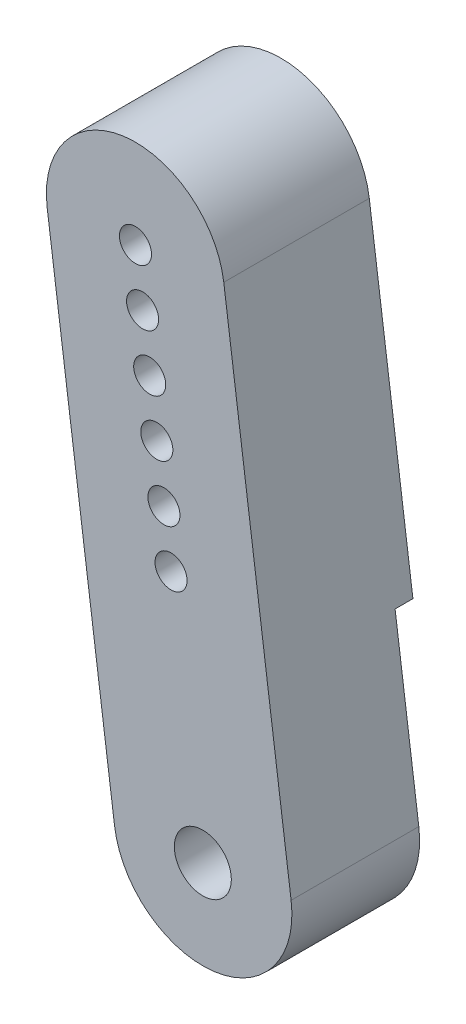
ISO-10303-21;
HEADER;
FILE_DESCRIPTION(('STEP AP214'),'2;1');
FILE_NAME('part.step','',(''),(''),'','','');
FILE_SCHEMA(('AUTOMOTIVE_DESIGN { 1 0 10303 214 1 1 1 1 }'));
ENDSEC;
DATA;
#1=APPLICATION_CONTEXT('core data for automotive mechanical design processes');
#2=APPLICATION_PROTOCOL_DEFINITION('international standard','automotive_design',2000,#1);
#3=PRODUCT_CONTEXT('',#1,'mechanical');
#4=PRODUCT('Part','Part','',(#3));
#5=PRODUCT_RELATED_PRODUCT_CATEGORY('part','',(#4));
#6=PRODUCT_DEFINITION_FORMATION('','',#4);
#7=PRODUCT_DEFINITION_CONTEXT('part definition',#1,'design');
#8=PRODUCT_DEFINITION('design','',#6,#7);
#9=PRODUCT_DEFINITION_SHAPE('','',#8);
#10=(LENGTH_UNIT() NAMED_UNIT(*) SI_UNIT(.MILLI.,.METRE.));
#11=(NAMED_UNIT(*) PLANE_ANGLE_UNIT() SI_UNIT($,.RADIAN.));
#12=(NAMED_UNIT(*) SI_UNIT($,.STERADIAN.) SOLID_ANGLE_UNIT());
#13=UNCERTAINTY_MEASURE_WITH_UNIT(LENGTH_MEASURE(1.E-05),#10,'distance_accuracy_value','');
#14=(GEOMETRIC_REPRESENTATION_CONTEXT(3) GLOBAL_UNCERTAINTY_ASSIGNED_CONTEXT((#13)) GLOBAL_UNIT_ASSIGNED_CONTEXT((#10,
#11,#12)) REPRESENTATION_CONTEXT('',''));
#15=CARTESIAN_POINT('',(0.,0.,0.));
#16=DIRECTION('',(0.,0.,1.));
#17=DIRECTION('',(1.,0.,0.));
#18=AXIS2_PLACEMENT_3D('',#15,#16,#17);
#19=CARTESIAN_POINT('',(-3.78016764213476,28.1472970744503,50.627013670792));
#20=DIRECTION('',(0.,0.,-1.));
#21=DIRECTION('',(-1.,0.,0.));
#22=AXIS2_PLACEMENT_3D('',#19,#20,#21);
#23=CYLINDRICAL_SURFACE('',#22,5.);
#24=CARTESIAN_POINT('',(-3.78016764213476,28.1472970744503,10.0670667485917));
#25=DIRECTION('',(0.,0.,1.));
#26=DIRECTION('',(1.,0.,0.));
#27=AXIS2_PLACEMENT_3D('',#24,#25,#26);
#28=CIRCLE('',#27,5.);
#29=CARTESIAN_POINT('',(1.17534240618396,28.8128195466571,10.0670667485917));
#30=VERTEX_POINT('',#29);
#31=CARTESIAN_POINT('',(-8.73567769045347,27.4817746022435,10.0670667485917));
#32=VERTEX_POINT('',#31);
#33=EDGE_CURVE('E133',#30,#32,#28,.T.);
#34=ORIENTED_EDGE('',*,*,#33,.F.);
#35=DIRECTION('',(0.,0.,-1.));
#36=VECTOR('',#35,1.);
#37=CARTESIAN_POINT('',(1.17534240618396,28.8128195466571,50.627013670792));
#38=LINE('',#37,#36);
#39=CARTESIAN_POINT('',(1.17534240618396,28.8128195466571,1.9));
#40=VERTEX_POINT('',#39);
#41=EDGE_CURVE('E43',#30,#40,#38,.T.);
#42=ORIENTED_EDGE('',*,*,#41,.T.);
#43=CARTESIAN_POINT('',(-3.78016764213475,28.1472970744503,1.9));
#44=DIRECTION('',(0.,0.,-1.));
#45=DIRECTION('',(1.,0.,0.));
#46=AXIS2_PLACEMENT_3D('',#43,#44,#45);
#47=CIRCLE('',#46,5.);
#48=CARTESIAN_POINT('',(-8.73567769045347,27.4817746022435,1.9));
#49=VERTEX_POINT('',#48);
#50=EDGE_CURVE('E105',#49,#40,#47,.T.);
#51=ORIENTED_EDGE('',*,*,#50,.F.);
#52=DIRECTION('',(0.,0.,-1.));
#53=VECTOR('',#52,1.);
#54=CARTESIAN_POINT('',(-8.73567769045347,27.4817746022435,50.627013670792));
#55=LINE('',#54,#53);
#56=EDGE_CURVE('E101',#32,#49,#55,.T.);
#57=ORIENTED_EDGE('',*,*,#56,.F.);
#58=EDGE_LOOP('',(#34,#42,#51,#57));
#59=FACE_BOUND('',#58,.T.);
#60=ADVANCED_FACE('F39',(#59),#23,.T.);
#61=CARTESIAN_POINT('',(-4.95551004831871,-0.665522472206823,50.627013670792));
#62=DIRECTION('',(0.991102009663742,0.133104494441364,0.));
#63=DIRECTION('',(-0.133104494441365,0.991102009663743,0.));
#64=AXIS2_PLACEMENT_3D('',#61,#62,#63);
#65=PLANE('',#64);
#66=DIRECTION('',(0.133104494441365,-0.991102009663743,0.));
#67=VECTOR('',#66,1.);
#68=CARTESIAN_POINT('',(-4.95551004831871,-0.665522472206848,10.0670667485917));
#69=LINE('',#68,#67);
#70=CARTESIAN_POINT('',(-4.95551004831871,-0.665522472206823,10.0670667485917));
#71=VERTEX_POINT('',#70);
#72=EDGE_CURVE('E48',#32,#71,#69,.T.);
#73=ORIENTED_EDGE('',*,*,#72,.F.);
#74=ORIENTED_EDGE('',*,*,#56,.T.);
#75=DIRECTION('',(-0.133104494441364,0.991102009663742,0.));
#76=VECTOR('',#75,1.);
#77=CARTESIAN_POINT('',(-8.73567769045347,27.4817746022435,1.9));
#78=LINE('',#77,#76);
#79=CARTESIAN_POINT('',(-6.28655499272111,9.24549762434681,1.9));
#80=VERTEX_POINT('',#79);
#81=EDGE_CURVE('E95',#80,#49,#78,.T.);
#82=ORIENTED_EDGE('',*,*,#81,.F.);
#83=DIRECTION('',(0.,0.,1.));
#84=VECTOR('',#83,1.);
#85=CARTESIAN_POINT('',(-6.28655499272111,9.24549762434681,1.9));
#86=LINE('',#85,#84);
#87=CARTESIAN_POINT('',(-6.28655499272111,9.24549762434681,2.9));
#88=VERTEX_POINT('',#87);
#89=EDGE_CURVE('E99',#80,#88,#86,.T.);
#90=ORIENTED_EDGE('',*,*,#89,.T.);
#91=DIRECTION('',(0.133104494441364,-0.991102009663742,0.));
#92=VECTOR('',#91,1.);
#93=CARTESIAN_POINT('',(-4.95551004831871,-0.665522472206823,2.9));
#94=LINE('',#93,#92);
#95=CARTESIAN_POINT('',(-4.95551004831871,-0.665522472206823,2.9));
#96=VERTEX_POINT('',#95);
#97=EDGE_CURVE('E129',#88,#96,#94,.T.);
#98=ORIENTED_EDGE('',*,*,#97,.T.);
#99=DIRECTION('',(0.,0.,-1.));
#100=VECTOR('',#99,1.);
#101=CARTESIAN_POINT('',(-4.95551004831871,-0.665522472206823,50.627013670792));
#102=LINE('',#101,#100);
#103=EDGE_CURVE('E128',#71,#96,#102,.T.);
#104=ORIENTED_EDGE('',*,*,#103,.F.);
#105=EDGE_LOOP('',(#73,#74,#82,#90,#98,#104));
#106=FACE_BOUND('',#105,.T.);
#107=ADVANCED_FACE('F97',(#106),#65,.F.);
#108=CARTESIAN_POINT('',(0.,0.,50.627013670792));
#109=DIRECTION('',(0.,0.,-1.));
#110=DIRECTION('',(-1.,0.,0.));
#111=AXIS2_PLACEMENT_3D('',#108,#109,#110);
#112=CYLINDRICAL_SURFACE('',#111,5.);
#113=CARTESIAN_POINT('',(0.,0.,10.0670667485917));
#114=DIRECTION('',(0.,0.,1.));
#115=DIRECTION('',(1.,0.,0.));
#116=AXIS2_PLACEMENT_3D('',#113,#114,#115);
#117=CIRCLE('',#116,5.);
#118=CARTESIAN_POINT('',(4.95551004831871,0.665522472206824,10.0670667485917));
#119=VERTEX_POINT('',#118);
#120=EDGE_CURVE('E11',#71,#119,#117,.T.);
#121=ORIENTED_EDGE('',*,*,#120,.F.);
#122=ORIENTED_EDGE('',*,*,#103,.T.);
#123=CARTESIAN_POINT('',(0.,0.,2.9));
#124=DIRECTION('',(0.,0.,1.));
#125=DIRECTION('',(-1.,0.,0.));
#126=AXIS2_PLACEMENT_3D('',#123,#124,#125);
#127=CIRCLE('',#126,5.);
#128=CARTESIAN_POINT('',(4.95551004831871,0.665522472206824,2.9));
#129=VERTEX_POINT('',#128);
#130=EDGE_CURVE('E125',#96,#129,#127,.T.);
#131=ORIENTED_EDGE('',*,*,#130,.T.);
#132=DIRECTION('',(0.,0.,-1.));
#133=VECTOR('',#132,1.);
#134=CARTESIAN_POINT('',(4.95551004831871,0.665522472206824,50.627013670792));
#135=LINE('',#134,#133);
#136=EDGE_CURVE('E124',#119,#129,#135,.T.);
#137=ORIENTED_EDGE('',*,*,#136,.F.);
#138=EDGE_LOOP('',(#121,#122,#131,#137));
#139=FACE_BOUND('',#138,.T.);
#140=ADVANCED_FACE('F143',(#139),#112,.T.);
#141=CARTESIAN_POINT('',(1.17534240618396,28.8128195466571,50.627013670792));
#142=DIRECTION('',(-0.991102009663742,-0.133104494441364,0.));
#143=DIRECTION('',(0.133104494441364,-0.991102009663743,0.));
#144=AXIS2_PLACEMENT_3D('',#141,#142,#143);
#145=PLANE('',#144);
#146=DIRECTION('',(-0.133104494441364,0.991102009663743,0.));
#147=VECTOR('',#146,1.);
#148=CARTESIAN_POINT('',(1.17534240618397,28.8128195466571,10.0670667485917));
#149=LINE('',#148,#147);
#150=EDGE_CURVE('E123',#119,#30,#149,.T.);
#151=ORIENTED_EDGE('',*,*,#150,.F.);
#152=ORIENTED_EDGE('',*,*,#136,.T.);
#153=DIRECTION('',(-0.133104494441364,0.991102009663742,0.));
#154=VECTOR('',#153,1.);
#155=CARTESIAN_POINT('',(1.17534240618396,28.8128195466571,2.9));
#156=LINE('',#155,#154);
#157=CARTESIAN_POINT('',(3.62446510391632,10.5765425687605,2.9));
#158=VERTEX_POINT('',#157);
#159=EDGE_CURVE('E121',#129,#158,#156,.T.);
#160=ORIENTED_EDGE('',*,*,#159,.T.);
#161=DIRECTION('',(0.,0.,1.));
#162=VECTOR('',#161,1.);
#163=CARTESIAN_POINT('',(3.62446510391632,10.5765425687605,1.9));
#164=LINE('',#163,#162);
#165=CARTESIAN_POINT('',(3.62446510391632,10.5765425687605,1.9));
#166=VERTEX_POINT('',#165);
#167=EDGE_CURVE('E116',#166,#158,#164,.T.);
#168=ORIENTED_EDGE('',*,*,#167,.F.);
#169=DIRECTION('',(0.133104494441364,-0.991102009663742,0.));
#170=VECTOR('',#169,1.);
#171=CARTESIAN_POINT('',(3.62446510391632,10.5765425687605,1.9));
#172=LINE('',#171,#170);
#173=EDGE_CURVE('E110',#40,#166,#172,.T.);
#174=ORIENTED_EDGE('',*,*,#173,.F.);
#175=ORIENTED_EDGE('',*,*,#41,.F.);
#176=EDGE_LOOP('',(#151,#152,#160,#168,#174,#175));
#177=FACE_BOUND('',#176,.T.);
#178=ADVANCED_FACE('F140',(#177),#145,.F.);
#179=CARTESIAN_POINT('',(-3.78016764213476,28.1472970744503,2.9));
#180=DIRECTION('',(0.,0.,-1.));
#181=DIRECTION('',(-1.,0.,0.));
#182=AXIS2_PLACEMENT_3D('',#179,#180,#181);
#183=PLANE('',#182);
#184=CARTESIAN_POINT('',(0.,0.,2.9));
#185=DIRECTION('',(0.,0.,-1.));
#186=DIRECTION('',(-1.,0.,0.));
#187=AXIS2_PLACEMENT_3D('',#184,#185,#186);
#188=CIRCLE('',#187,1.6);
#189=CARTESIAN_POINT('',(-1.6,0.,2.9));
#190=VERTEX_POINT('',#189);
#191=EDGE_CURVE('E288',#190,#190,#188,.T.);
#192=ORIENTED_EDGE('',*,*,#191,.F.);
#193=EDGE_LOOP('',(#192));
#194=FACE_BOUND('',#193,.T.);
#195=DIRECTION('',(-0.991102009663742,-0.133104494441364,0.));
#196=VECTOR('',#195,1.);
#197=CARTESIAN_POINT('',(-6.28655499272111,9.24549762434681,2.9));
#198=LINE('',#197,#196);
#199=EDGE_CURVE('E56',#158,#88,#198,.T.);
#200=ORIENTED_EDGE('',*,*,#199,.F.);
#201=ORIENTED_EDGE('',*,*,#159,.F.);
#202=ORIENTED_EDGE('',*,*,#130,.F.);
#203=ORIENTED_EDGE('',*,*,#97,.F.);
#204=EDGE_LOOP('',(#200,#201,#202,#203));
#205=FACE_BOUND('',#204,.T.);
#206=ADVANCED_FACE('F145',(#194,#205),#183,.T.);
#207=CARTESIAN_POINT('',(0.,-1.66533453693773E-13,10.0670667485917));
#208=DIRECTION('',(0.,0.,1.));
#209=DIRECTION('',(-0.133104494441365,0.991102009663742,0.));
#210=AXIS2_PLACEMENT_3D('',#207,#208,#209);
#211=PLANE('',#210);
#212=CARTESIAN_POINT('',(0.,0.,10.0670667485917));
#213=DIRECTION('',(0.,0.,1.));
#214=DIRECTION('',(1.,0.,0.));
#215=AXIS2_PLACEMENT_3D('',#212,#213,#214);
#216=CIRCLE('',#215,1.6);
#217=CARTESIAN_POINT('',(1.6,0.,10.0670667485917));
#218=VERTEX_POINT('',#217);
#219=EDGE_CURVE('E286',#218,#218,#216,.F.);
#220=ORIENTED_EDGE('',*,*,#219,.T.);
#221=EDGE_LOOP('',(#220));
#222=FACE_BOUND('',#221,.T.);
#223=CARTESIAN_POINT('',(-3.78016764213475,28.1472970744503,10.0670667485917));
#224=DIRECTION('',(0.,0.,1.));
#225=DIRECTION('',(1.,0.,0.));
#226=AXIS2_PLACEMENT_3D('',#223,#224,#225);
#227=CIRCLE('',#226,0.9);
#228=CARTESIAN_POINT('',(-2.88016764213475,28.1472970744503,10.0670667485917));
#229=VERTEX_POINT('',#228);
#230=EDGE_CURVE('E299',#229,#229,#227,.F.);
#231=ORIENTED_EDGE('',*,*,#230,.T.);
#232=EDGE_LOOP('',(#231));
#233=FACE_BOUND('',#232,.T.);
#234=CARTESIAN_POINT('',(-3.38085415881066,25.1739910454591,10.0670667485917));
#235=DIRECTION('',(0.,0.,1.));
#236=DIRECTION('',(1.,0.,0.));
#237=AXIS2_PLACEMENT_3D('',#234,#235,#236);
#238=CIRCLE('',#237,0.9);
#239=CARTESIAN_POINT('',(-2.48085415881066,25.1739910454591,10.0670667485917));
#240=VERTEX_POINT('',#239);
#241=EDGE_CURVE('E302',#240,#240,#238,.F.);
#242=ORIENTED_EDGE('',*,*,#241,.T.);
#243=EDGE_LOOP('',(#242));
#244=FACE_BOUND('',#243,.T.);
#245=CARTESIAN_POINT('',(-2.98154067548657,22.2006850164678,10.0670667485917));
#246=DIRECTION('',(0.,0.,1.));
#247=DIRECTION('',(1.,0.,0.));
#248=AXIS2_PLACEMENT_3D('',#245,#246,#247);
#249=CIRCLE('',#248,0.9);
#250=CARTESIAN_POINT('',(-2.08154067548657,22.2006850164678,10.0670667485917));
#251=VERTEX_POINT('',#250);
#252=EDGE_CURVE('E308',#251,#251,#249,.F.);
#253=ORIENTED_EDGE('',*,*,#252,.T.);
#254=EDGE_LOOP('',(#253));
#255=FACE_BOUND('',#254,.T.);
#256=CARTESIAN_POINT('',(-2.58222719216247,19.2273789874766,10.0670667485917));
#257=DIRECTION('',(0.,0.,1.));
#258=DIRECTION('',(1.,0.,0.));
#259=AXIS2_PLACEMENT_3D('',#256,#257,#258);
#260=CIRCLE('',#259,0.9);
#261=CARTESIAN_POINT('',(-1.68222719216247,19.2273789874766,10.0670667485917));
#262=VERTEX_POINT('',#261);
#263=EDGE_CURVE('E314',#262,#262,#260,.F.);
#264=ORIENTED_EDGE('',*,*,#263,.T.);
#265=EDGE_LOOP('',(#264));
#266=FACE_BOUND('',#265,.T.);
#267=CARTESIAN_POINT('',(-2.18291370883838,16.2540729584854,10.0670667485917));
#268=DIRECTION('',(0.,0.,1.));
#269=DIRECTION('',(1.,0.,0.));
#270=AXIS2_PLACEMENT_3D('',#267,#268,#269);
#271=CIRCLE('',#270,0.899999999999999);
#272=CARTESIAN_POINT('',(-1.28291370883838,16.2540729584854,10.0670667485917));
#273=VERTEX_POINT('',#272);
#274=EDGE_CURVE('E320',#273,#273,#271,.F.);
#275=ORIENTED_EDGE('',*,*,#274,.T.);
#276=EDGE_LOOP('',(#275));
#277=FACE_BOUND('',#276,.T.);
#278=CARTESIAN_POINT('',(-1.78360022551429,13.2807669294941,10.0670667485917));
#279=DIRECTION('',(0.,0.,1.));
#280=DIRECTION('',(1.,0.,0.));
#281=AXIS2_PLACEMENT_3D('',#278,#279,#280);
#282=CIRCLE('',#281,0.9);
#283=CARTESIAN_POINT('',(-0.883600225514286,13.2807669294941,10.0670667485917));
#284=VERTEX_POINT('',#283);
#285=EDGE_CURVE('E292',#284,#284,#282,.F.);
#286=ORIENTED_EDGE('',*,*,#285,.T.);
#287=EDGE_LOOP('',(#286));
#288=FACE_BOUND('',#287,.T.);
#289=ORIENTED_EDGE('',*,*,#150,.T.);
#290=ORIENTED_EDGE('',*,*,#33,.T.);
#291=ORIENTED_EDGE('',*,*,#72,.T.);
#292=ORIENTED_EDGE('',*,*,#120,.T.);
#293=EDGE_LOOP('',(#289,#290,#291,#292));
#294=FACE_BOUND('',#293,.T.);
#295=ADVANCED_FACE('F41',(#222,#233,#244,#255,#266,#277,#288,#294),#211,.T.);
#296=CARTESIAN_POINT('',(-6.28655499272111,9.24549762434681,1.9));
#297=DIRECTION('',(-0.133104494441364,0.991102009663742,0.));
#298=DIRECTION('',(-0.991102009663743,-0.133104494441364,0.));
#299=AXIS2_PLACEMENT_3D('',#296,#297,#298);
#300=PLANE('',#299);
#301=ORIENTED_EDGE('',*,*,#199,.T.);
#302=ORIENTED_EDGE('',*,*,#89,.F.);
#303=DIRECTION('',(-0.991102009663742,-0.133104494441364,0.));
#304=VECTOR('',#303,1.);
#305=CARTESIAN_POINT('',(-6.28655499272111,9.24549762434681,1.9));
#306=LINE('',#305,#304);
#307=EDGE_CURVE('E106',#166,#80,#306,.T.);
#308=ORIENTED_EDGE('',*,*,#307,.F.);
#309=ORIENTED_EDGE('',*,*,#167,.T.);
#310=EDGE_LOOP('',(#301,#302,#308,#309));
#311=FACE_BOUND('',#310,.T.);
#312=ADVANCED_FACE('F115',(#311),#300,.F.);
#313=CARTESIAN_POINT('',(-3.78016764213475,28.1472970744503,1.9));
#314=DIRECTION('',(0.,0.,1.));
#315=DIRECTION('',(1.,0.,0.));
#316=AXIS2_PLACEMENT_3D('',#313,#314,#315);
#317=PLANE('',#316);
#318=CARTESIAN_POINT('',(-3.78016764213475,28.1472970744503,1.9));
#319=DIRECTION('',(0.,0.,-1.));
#320=DIRECTION('',(-1.,0.,0.));
#321=AXIS2_PLACEMENT_3D('',#318,#319,#320);
#322=CIRCLE('',#321,0.9);
#323=CARTESIAN_POINT('',(-4.68016764213475,28.1472970744503,1.9));
#324=VERTEX_POINT('',#323);
#325=EDGE_CURVE('E296',#324,#324,#322,.T.);
#326=ORIENTED_EDGE('',*,*,#325,.F.);
#327=EDGE_LOOP('',(#326));
#328=FACE_BOUND('',#327,.T.);
#329=CARTESIAN_POINT('',(-3.38085415881066,25.1739910454591,1.9));
#330=DIRECTION('',(0.,0.,-1.));
#331=DIRECTION('',(-1.,0.,0.));
#332=AXIS2_PLACEMENT_3D('',#329,#330,#331);
#333=CIRCLE('',#332,0.9);
#334=CARTESIAN_POINT('',(-4.28085415881066,25.1739910454591,1.9));
#335=VERTEX_POINT('',#334);
#336=EDGE_CURVE('E305',#335,#335,#333,.T.);
#337=ORIENTED_EDGE('',*,*,#336,.F.);
#338=EDGE_LOOP('',(#337));
#339=FACE_BOUND('',#338,.T.);
#340=CARTESIAN_POINT('',(-2.98154067548657,22.2006850164678,1.9));
#341=DIRECTION('',(0.,0.,-1.));
#342=DIRECTION('',(-1.,0.,0.));
#343=AXIS2_PLACEMENT_3D('',#340,#341,#342);
#344=CIRCLE('',#343,0.9);
#345=CARTESIAN_POINT('',(-3.88154067548657,22.2006850164678,1.9));
#346=VERTEX_POINT('',#345);
#347=EDGE_CURVE('E311',#346,#346,#344,.T.);
#348=ORIENTED_EDGE('',*,*,#347,.F.);
#349=EDGE_LOOP('',(#348));
#350=FACE_BOUND('',#349,.T.);
#351=CARTESIAN_POINT('',(-2.58222719216247,19.2273789874766,1.9));
#352=DIRECTION('',(0.,0.,-1.));
#353=DIRECTION('',(-1.,0.,0.));
#354=AXIS2_PLACEMENT_3D('',#351,#352,#353);
#355=CIRCLE('',#354,0.9);
#356=CARTESIAN_POINT('',(-3.48222719216247,19.2273789874766,1.9));
#357=VERTEX_POINT('',#356);
#358=EDGE_CURVE('E317',#357,#357,#355,.T.);
#359=ORIENTED_EDGE('',*,*,#358,.F.);
#360=EDGE_LOOP('',(#359));
#361=FACE_BOUND('',#360,.T.);
#362=CARTESIAN_POINT('',(-2.18291370883838,16.2540729584854,1.9));
#363=DIRECTION('',(0.,0.,-1.));
#364=DIRECTION('',(-1.,0.,0.));
#365=AXIS2_PLACEMENT_3D('',#362,#363,#364);
#366=CIRCLE('',#365,0.899999999999999);
#367=CARTESIAN_POINT('',(-3.08291370883838,16.2540729584854,1.9));
#368=VERTEX_POINT('',#367);
#369=EDGE_CURVE('E323',#368,#368,#366,.T.);
#370=ORIENTED_EDGE('',*,*,#369,.F.);
#371=EDGE_LOOP('',(#370));
#372=FACE_BOUND('',#371,.T.);
#373=CARTESIAN_POINT('',(-1.78360022551429,13.2807669294941,1.9));
#374=DIRECTION('',(0.,0.,-1.));
#375=DIRECTION('',(-1.,0.,0.));
#376=AXIS2_PLACEMENT_3D('',#373,#374,#375);
#377=CIRCLE('',#376,0.9);
#378=CARTESIAN_POINT('',(-2.68360022551429,13.2807669294941,1.9));
#379=VERTEX_POINT('',#378);
#380=EDGE_CURVE('E289',#379,#379,#377,.T.);
#381=ORIENTED_EDGE('',*,*,#380,.F.);
#382=EDGE_LOOP('',(#381));
#383=FACE_BOUND('',#382,.T.);
#384=ORIENTED_EDGE('',*,*,#307,.T.);
#385=ORIENTED_EDGE('',*,*,#81,.T.);
#386=ORIENTED_EDGE('',*,*,#50,.T.);
#387=ORIENTED_EDGE('',*,*,#173,.T.);
#388=EDGE_LOOP('',(#384,#385,#386,#387));
#389=FACE_BOUND('',#388,.T.);
#390=ADVANCED_FACE('F109',(#328,#339,#350,#361,#372,#383,#389),#317,.F.);
#391=CARTESIAN_POINT('',(-1.78360022551429,13.2807669294941,10.0680667485917));
#392=DIRECTION('',(0.,0.,-1.));
#393=DIRECTION('',(-1.,0.,0.));
#394=AXIS2_PLACEMENT_3D('',#391,#392,#393);
#395=CYLINDRICAL_SURFACE('',#394,0.9);
#396=ORIENTED_EDGE('',*,*,#285,.F.);
#397=EDGE_LOOP('',(#396));
#398=FACE_BOUND('',#397,.T.);
#399=ORIENTED_EDGE('',*,*,#380,.T.);
#400=EDGE_LOOP('',(#399));
#401=FACE_BOUND('',#400,.T.);
#402=ADVANCED_FACE('F216',(#398,#401),#395,.F.);
#403=CARTESIAN_POINT('',(-2.18291370883838,16.2540729584854,10.0680667485917));
#404=DIRECTION('',(0.,0.,-1.));
#405=DIRECTION('',(-1.,0.,0.));
#406=AXIS2_PLACEMENT_3D('',#403,#404,#405);
#407=CYLINDRICAL_SURFACE('',#406,0.899999999999999);
#408=ORIENTED_EDGE('',*,*,#274,.F.);
#409=EDGE_LOOP('',(#408));
#410=FACE_BOUND('',#409,.T.);
#411=ORIENTED_EDGE('',*,*,#369,.T.);
#412=EDGE_LOOP('',(#411));
#413=FACE_BOUND('',#412,.T.);
#414=ADVANCED_FACE('F225',(#410,#413),#407,.F.);
#415=CARTESIAN_POINT('',(-2.58222719216247,19.2273789874766,10.0680667485917));
#416=DIRECTION('',(0.,0.,-1.));
#417=DIRECTION('',(-1.,0.,0.));
#418=AXIS2_PLACEMENT_3D('',#415,#416,#417);
#419=CYLINDRICAL_SURFACE('',#418,0.9);
#420=ORIENTED_EDGE('',*,*,#263,.F.);
#421=EDGE_LOOP('',(#420));
#422=FACE_BOUND('',#421,.T.);
#423=ORIENTED_EDGE('',*,*,#358,.T.);
#424=EDGE_LOOP('',(#423));
#425=FACE_BOUND('',#424,.T.);
#426=ADVANCED_FACE('F234',(#422,#425),#419,.F.);
#427=CARTESIAN_POINT('',(-2.98154067548657,22.2006850164678,10.0680667485917));
#428=DIRECTION('',(0.,0.,-1.));
#429=DIRECTION('',(-1.,0.,0.));
#430=AXIS2_PLACEMENT_3D('',#427,#428,#429);
#431=CYLINDRICAL_SURFACE('',#430,0.9);
#432=ORIENTED_EDGE('',*,*,#252,.F.);
#433=EDGE_LOOP('',(#432));
#434=FACE_BOUND('',#433,.T.);
#435=ORIENTED_EDGE('',*,*,#347,.T.);
#436=EDGE_LOOP('',(#435));
#437=FACE_BOUND('',#436,.T.);
#438=ADVANCED_FACE('F243',(#434,#437),#431,.F.);
#439=CARTESIAN_POINT('',(-3.38085415881066,25.1739910454591,10.0680667485917));
#440=DIRECTION('',(0.,0.,-1.));
#441=DIRECTION('',(-1.,0.,0.));
#442=AXIS2_PLACEMENT_3D('',#439,#440,#441);
#443=CYLINDRICAL_SURFACE('',#442,0.9);
#444=ORIENTED_EDGE('',*,*,#241,.F.);
#445=EDGE_LOOP('',(#444));
#446=FACE_BOUND('',#445,.T.);
#447=ORIENTED_EDGE('',*,*,#336,.T.);
#448=EDGE_LOOP('',(#447));
#449=FACE_BOUND('',#448,.T.);
#450=ADVANCED_FACE('F252',(#446,#449),#443,.F.);
#451=CARTESIAN_POINT('',(-3.78016764213475,28.1472970744503,10.0680667485917));
#452=DIRECTION('',(0.,0.,-1.));
#453=DIRECTION('',(-1.,0.,0.));
#454=AXIS2_PLACEMENT_3D('',#451,#452,#453);
#455=CYLINDRICAL_SURFACE('',#454,0.9);
#456=ORIENTED_EDGE('',*,*,#230,.F.);
#457=EDGE_LOOP('',(#456));
#458=FACE_BOUND('',#457,.T.);
#459=ORIENTED_EDGE('',*,*,#325,.T.);
#460=EDGE_LOOP('',(#459));
#461=FACE_BOUND('',#460,.T.);
#462=ADVANCED_FACE('F260',(#458,#461),#455,.F.);
#463=CARTESIAN_POINT('',(0.,0.,10.0680667485917));
#464=DIRECTION('',(0.,0.,-1.));
#465=DIRECTION('',(-1.,0.,0.));
#466=AXIS2_PLACEMENT_3D('',#463,#464,#465);
#467=CYLINDRICAL_SURFACE('',#466,1.6);
#468=ORIENTED_EDGE('',*,*,#219,.F.);
#469=EDGE_LOOP('',(#468));
#470=FACE_BOUND('',#469,.T.);
#471=ORIENTED_EDGE('',*,*,#191,.T.);
#472=EDGE_LOOP('',(#471));
#473=FACE_BOUND('',#472,.T.);
#474=ADVANCED_FACE('F268',(#470,#473),#467,.F.);
#475=CLOSED_SHELL('',(#60,#107,#140,#178,#206,#295,#312,#390,#402,#414,#426,#438,#450,#462,#474));
#476=MANIFOLD_SOLID_BREP('B2',#475);
#477=ADVANCED_BREP_SHAPE_REPRESENTATION('',(#18,#476),#14);
#478=SHAPE_DEFINITION_REPRESENTATION(#9,#477);
ENDSEC;
END-ISO-10303-21;
